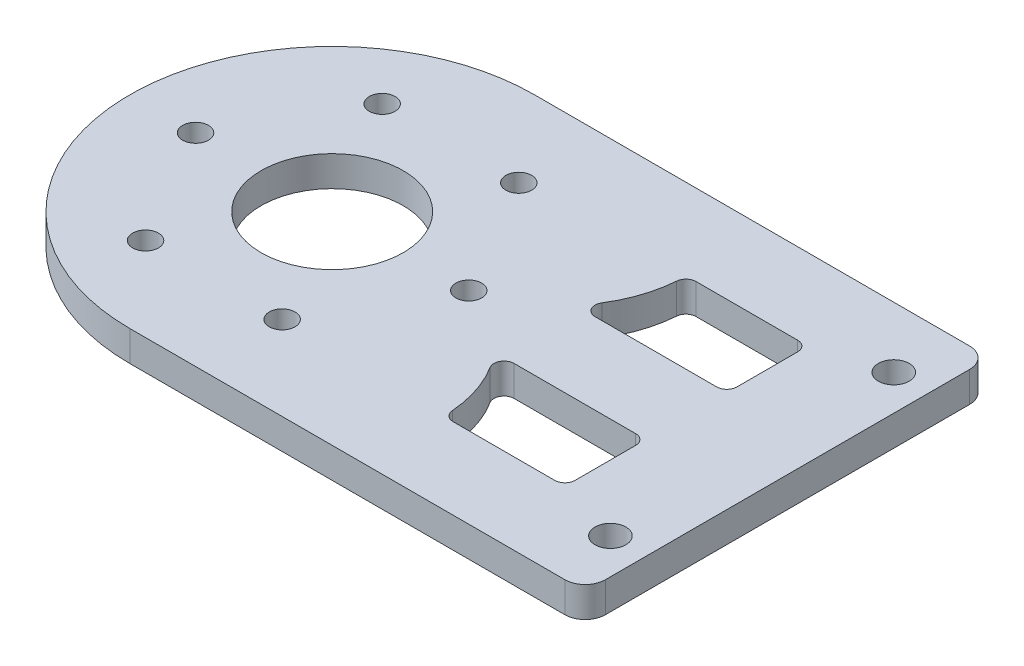
ISO-10303-21;
HEADER;
FILE_DESCRIPTION(('STEP AP214'),'2;1');
FILE_NAME('part.step','',(''),(''),'','','');
FILE_SCHEMA(('AUTOMOTIVE_DESIGN { 1 0 10303 214 1 1 1 1 }'));
ENDSEC;
DATA;
#1=APPLICATION_CONTEXT('core data for automotive mechanical design processes');
#2=APPLICATION_PROTOCOL_DEFINITION('international standard','automotive_design',2000,#1);
#3=PRODUCT_CONTEXT('',#1,'mechanical');
#4=PRODUCT('Part','Part','',(#3));
#5=PRODUCT_RELATED_PRODUCT_CATEGORY('part','',(#4));
#6=PRODUCT_DEFINITION_FORMATION('','',#4);
#7=PRODUCT_DEFINITION_CONTEXT('part definition',#1,'design');
#8=PRODUCT_DEFINITION('design','',#6,#7);
#9=PRODUCT_DEFINITION_SHAPE('','',#8);
#10=(LENGTH_UNIT() NAMED_UNIT(*) SI_UNIT(.MILLI.,.METRE.));
#11=(NAMED_UNIT(*) PLANE_ANGLE_UNIT() SI_UNIT($,.RADIAN.));
#12=(NAMED_UNIT(*) SI_UNIT($,.STERADIAN.) SOLID_ANGLE_UNIT());
#13=UNCERTAINTY_MEASURE_WITH_UNIT(LENGTH_MEASURE(1.E-05),#10,'distance_accuracy_value','');
#14=(GEOMETRIC_REPRESENTATION_CONTEXT(3) GLOBAL_UNCERTAINTY_ASSIGNED_CONTEXT((#13)) GLOBAL_UNIT_ASSIGNED_CONTEXT((#10,
#11,#12)) REPRESENTATION_CONTEXT('',''));
#15=CARTESIAN_POINT('',(0.,0.,0.));
#16=DIRECTION('',(0.,0.,1.));
#17=DIRECTION('',(1.,0.,0.));
#18=AXIS2_PLACEMENT_3D('',#15,#16,#17);
#19=CARTESIAN_POINT('',(0.,0.,0.));
#20=DIRECTION('',(0.,1.,0.));
#21=DIRECTION('',(0.,0.,1.));
#22=AXIS2_PLACEMENT_3D('',#19,#20,#21);
#23=PLANE('',#22);
#24=CARTESIAN_POINT('',(-11.6666666651634,0.,-12.0000000016373));
#25=DIRECTION('',(0.,1.,0.));
#26=DIRECTION('',(0.,0.,1.));
#27=AXIS2_PLACEMENT_3D('',#24,#25,#26);
#28=CIRCLE('',#27,12.1666666666667);
#29=CARTESIAN_POINT('',(-1.36190229421553,0.,-5.53164557125699));
#30=VERTEX_POINT('',#29);
#31=CARTESIAN_POINT('',(0.464858721431306,0.,-11.0759493687252));
#32=VERTEX_POINT('',#31);
#33=EDGE_CURVE('E305',#30,#32,#28,.T.);
#34=ORIENTED_EDGE('',*,*,#33,.F.);
#35=CARTESIAN_POINT('',(-0.514935359617072,0.,-5.0000000016367));
#36=DIRECTION('',(0.,1.,0.));
#37=DIRECTION('',(0.,0.,1.));
#38=AXIS2_PLACEMENT_3D('',#35,#36,#37);
#39=CIRCLE('',#38,1.);
#40=CARTESIAN_POINT('',(-0.514935359617072,0.,-4.0000000016367));
#41=VERTEX_POINT('',#40);
#42=EDGE_CURVE('E282',#41,#30,#39,.F.);
#43=ORIENTED_EDGE('',*,*,#42,.F.);
#44=DIRECTION('',(-1.,0.,0.));
#45=VECTOR('',#44,1.);
#46=CARTESIAN_POINT('',(2.14838320450944E-13,0.,-4.00000000163667));
#47=LINE('',#46,#45);
#48=CARTESIAN_POINT('',(11.5000000015028,0.,-4.00000000163605));
#49=VERTEX_POINT('',#48);
#50=EDGE_CURVE('E250',#49,#41,#47,.T.);
#51=ORIENTED_EDGE('',*,*,#50,.F.);
#52=CARTESIAN_POINT('',(11.5000000015029,0.,-5.00000000163605));
#53=DIRECTION('',(0.,1.,0.));
#54=DIRECTION('',(0.,0.,1.));
#55=AXIS2_PLACEMENT_3D('',#52,#53,#54);
#56=CIRCLE('',#55,1.);
#57=CARTESIAN_POINT('',(12.5000000015029,0.,-5.000000001636));
#58=VERTEX_POINT('',#57);
#59=EDGE_CURVE('E295',#58,#49,#56,.F.);
#60=ORIENTED_EDGE('',*,*,#59,.F.);
#61=DIRECTION('',(0.,0.,1.));
#62=VECTOR('',#61,1.);
#63=CARTESIAN_POINT('',(12.5000000015026,0.,6.68591339779764E-13));
#64=LINE('',#63,#62);
#65=CARTESIAN_POINT('',(12.5000000015032,0.,-11.000000001636));
#66=VERTEX_POINT('',#65);
#67=EDGE_CURVE('E297',#66,#58,#64,.T.);
#68=ORIENTED_EDGE('',*,*,#67,.F.);
#69=CARTESIAN_POINT('',(11.5000000015032,0.,-11.000000001636));
#70=DIRECTION('',(0.,1.,0.));
#71=DIRECTION('',(0.,0.,1.));
#72=AXIS2_PLACEMENT_3D('',#69,#70,#71);
#73=CIRCLE('',#72,1.);
#74=CARTESIAN_POINT('',(11.5000000015032,0.,-12.0000000016361));
#75=VERTEX_POINT('',#74);
#76=EDGE_CURVE('E299',#75,#66,#73,.F.);
#77=ORIENTED_EDGE('',*,*,#76,.F.);
#78=DIRECTION('',(1.,0.,0.));
#79=VECTOR('',#78,1.);
#80=CARTESIAN_POINT('',(6.40798533503077E-13,0.,-12.0000000016367));
#81=LINE('',#80,#79);
#82=CARTESIAN_POINT('',(1.46197039704183,0.,-12.0000000016366));
#83=VERTEX_POINT('',#82);
#84=EDGE_CURVE('E301',#83,#75,#81,.T.);
#85=ORIENTED_EDGE('',*,*,#84,.F.);
#86=CARTESIAN_POINT('',(1.46197039704183,0.,-11.0000000016366));
#87=DIRECTION('',(0.,1.,0.));
#88=DIRECTION('',(0.,0.,1.));
#89=AXIS2_PLACEMENT_3D('',#86,#87,#88);
#90=CIRCLE('',#89,1.);
#91=EDGE_CURVE('E303',#32,#83,#90,.F.);
#92=ORIENTED_EDGE('',*,*,#91,.F.);
#93=EDGE_LOOP('',(#34,#43,#51,#60,#68,#77,#85,#92));
#94=FACE_BOUND('',#93,.T.);
#95=CARTESIAN_POINT('',(-0.514935359617072,0.,5.0000000016367));
#96=DIRECTION('',(0.,1.,0.));
#97=DIRECTION('',(0.,0.,1.));
#98=AXIS2_PLACEMENT_3D('',#95,#96,#97);
#99=CIRCLE('',#98,1.);
#100=CARTESIAN_POINT('',(-0.514935359617126,0.,4.0000000016367));
#101=VERTEX_POINT('',#100);
#102=CARTESIAN_POINT('',(-1.36190229421553,0.,5.53164557125699));
#103=VERTEX_POINT('',#102);
#104=EDGE_CURVE('E365',#101,#103,#99,.T.);
#105=ORIENTED_EDGE('',*,*,#104,.T.);
#106=CARTESIAN_POINT('',(-11.6666666651634,0.,12.0000000016373));
#107=DIRECTION('',(0.,1.,0.));
#108=DIRECTION('',(0.,0.,1.));
#109=AXIS2_PLACEMENT_3D('',#106,#107,#108);
#110=CIRCLE('',#109,12.1666666666667);
#111=CARTESIAN_POINT('',(0.464858721431306,0.,11.0759493687252));
#112=VERTEX_POINT('',#111);
#113=EDGE_CURVE('E368',#103,#112,#110,.F.);
#114=ORIENTED_EDGE('',*,*,#113,.T.);
#115=CARTESIAN_POINT('',(1.46197039704183,0.,11.0000000016366));
#116=DIRECTION('',(0.,1.,0.));
#117=DIRECTION('',(0.,0.,1.));
#118=AXIS2_PLACEMENT_3D('',#115,#116,#117);
#119=CIRCLE('',#118,1.);
#120=CARTESIAN_POINT('',(1.46197039704183,0.,12.0000000016366));
#121=VERTEX_POINT('',#120);
#122=EDGE_CURVE('E333',#112,#121,#119,.T.);
#123=ORIENTED_EDGE('',*,*,#122,.T.);
#124=DIRECTION('',(1.,0.,0.));
#125=VECTOR('',#124,1.);
#126=CARTESIAN_POINT('',(6.40798533503077E-13,0.,12.0000000016367));
#127=LINE('',#126,#125);
#128=CARTESIAN_POINT('',(11.5000000015032,0.,12.0000000016361));
#129=VERTEX_POINT('',#128);
#130=EDGE_CURVE('E350',#121,#129,#127,.T.);
#131=ORIENTED_EDGE('',*,*,#130,.T.);
#132=CARTESIAN_POINT('',(11.5000000015032,0.,11.000000001636));
#133=DIRECTION('',(0.,1.,0.));
#134=DIRECTION('',(0.,0.,1.));
#135=AXIS2_PLACEMENT_3D('',#132,#133,#134);
#136=CIRCLE('',#135,1.);
#137=CARTESIAN_POINT('',(12.5000000015032,0.,11.000000001636));
#138=VERTEX_POINT('',#137);
#139=EDGE_CURVE('E353',#129,#138,#136,.T.);
#140=ORIENTED_EDGE('',*,*,#139,.T.);
#141=DIRECTION('',(0.,0.,-1.));
#142=VECTOR('',#141,1.);
#143=CARTESIAN_POINT('',(12.5000000015026,0.,-6.68591339779764E-13));
#144=LINE('',#143,#142);
#145=CARTESIAN_POINT('',(12.5000000015029,0.,5.000000001636));
#146=VERTEX_POINT('',#145);
#147=EDGE_CURVE('E356',#138,#146,#144,.T.);
#148=ORIENTED_EDGE('',*,*,#147,.T.);
#149=CARTESIAN_POINT('',(11.5000000015029,0.,5.00000000163605));
#150=DIRECTION('',(0.,1.,0.));
#151=DIRECTION('',(0.,0.,1.));
#152=AXIS2_PLACEMENT_3D('',#149,#150,#151);
#153=CIRCLE('',#152,1.);
#154=CARTESIAN_POINT('',(11.5000000015028,0.,4.00000000163605));
#155=VERTEX_POINT('',#154);
#156=EDGE_CURVE('E359',#146,#155,#153,.T.);
#157=ORIENTED_EDGE('',*,*,#156,.T.);
#158=DIRECTION('',(-1.,0.,0.));
#159=VECTOR('',#158,1.);
#160=CARTESIAN_POINT('',(2.14838320450944E-13,0.,4.00000000163667));
#161=LINE('',#160,#159);
#162=EDGE_CURVE('E362',#155,#101,#161,.T.);
#163=ORIENTED_EDGE('',*,*,#162,.T.);
#164=EDGE_LOOP('',(#105,#114,#123,#131,#140,#148,#157,#163));
#165=FACE_BOUND('',#164,.T.);
#166=CARTESIAN_POINT('',(19.,0.,14.000000000098));
#167=DIRECTION('',(0.,1.,0.));
#168=DIRECTION('',(0.,0.,1.));
#169=AXIS2_PLACEMENT_3D('',#166,#167,#168);
#170=CIRCLE('',#169,1.525);
#171=CARTESIAN_POINT('',(19.,0.,15.525000000098));
#172=VERTEX_POINT('',#171);
#173=EDGE_CURVE('E372',#172,#172,#170,.T.);
#174=ORIENTED_EDGE('',*,*,#173,.T.);
#175=EDGE_LOOP('',(#174));
#176=FACE_BOUND('',#175,.T.);
#177=CARTESIAN_POINT('',(19.,0.,-14.000000000098));
#178=DIRECTION('',(0.,1.,0.));
#179=DIRECTION('',(0.,0.,1.));
#180=AXIS2_PLACEMENT_3D('',#177,#178,#179);
#181=CIRCLE('',#180,1.525);
#182=CARTESIAN_POINT('',(19.,0.,-12.475000000098));
#183=VERTEX_POINT('',#182);
#184=EDGE_CURVE('E379',#183,#183,#181,.T.);
#185=ORIENTED_EDGE('',*,*,#184,.T.);
#186=EDGE_LOOP('',(#185));
#187=FACE_BOUND('',#186,.T.);
#188=CARTESIAN_POINT('',(-22.5,0.,0.));
#189=DIRECTION('',(0.,1.,0.));
#190=DIRECTION('',(0.,0.,1.));
#191=AXIS2_PLACEMENT_3D('',#188,#189,#190);
#192=CIRCLE('',#191,7.025);
#193=CARTESIAN_POINT('',(-22.5,0.,7.025));
#194=VERTEX_POINT('',#193);
#195=EDGE_CURVE('E384',#194,#194,#192,.T.);
#196=ORIENTED_EDGE('',*,*,#195,.T.);
#197=EDGE_LOOP('',(#196));
#198=FACE_BOUND('',#197,.T.);
#199=CARTESIAN_POINT('',(-36.,0.,0.));
#200=DIRECTION('',(0.,1.,0.));
#201=DIRECTION('',(0.,0.,1.));
#202=AXIS2_PLACEMENT_3D('',#199,#200,#201);
#203=CIRCLE('',#202,1.275);
#204=CARTESIAN_POINT('',(-36.,0.,1.275));
#205=VERTEX_POINT('',#204);
#206=EDGE_CURVE('E394',#205,#205,#203,.T.);
#207=ORIENTED_EDGE('',*,*,#206,.T.);
#208=EDGE_LOOP('',(#207));
#209=FACE_BOUND('',#208,.T.);
#210=CARTESIAN_POINT('',(-29.25,0.,11.6913429510899));
#211=DIRECTION('',(0.,1.,0.));
#212=DIRECTION('',(0.,0.,1.));
#213=AXIS2_PLACEMENT_3D('',#210,#211,#212);
#214=CIRCLE('',#213,1.275);
#215=CARTESIAN_POINT('',(-29.25,0.,12.9663429510899));
#216=VERTEX_POINT('',#215);
#217=EDGE_CURVE('E387',#216,#216,#214,.T.);
#218=ORIENTED_EDGE('',*,*,#217,.T.);
#219=EDGE_LOOP('',(#218));
#220=FACE_BOUND('',#219,.T.);
#221=CARTESIAN_POINT('',(-15.75,0.,11.6913429510899));
#222=DIRECTION('',(0.,1.,0.));
#223=DIRECTION('',(0.,0.,1.));
#224=AXIS2_PLACEMENT_3D('',#221,#222,#223);
#225=CIRCLE('',#224,1.275);
#226=CARTESIAN_POINT('',(-15.75,0.,12.9663429510899));
#227=VERTEX_POINT('',#226);
#228=EDGE_CURVE('E401',#227,#227,#225,.T.);
#229=ORIENTED_EDGE('',*,*,#228,.T.);
#230=EDGE_LOOP('',(#229));
#231=FACE_BOUND('',#230,.T.);
#232=CARTESIAN_POINT('',(-8.99999999999998,0.,0.));
#233=DIRECTION('',(0.,1.,0.));
#234=DIRECTION('',(0.,0.,1.));
#235=AXIS2_PLACEMENT_3D('',#232,#233,#234);
#236=CIRCLE('',#235,1.275);
#237=CARTESIAN_POINT('',(-8.99999999999998,0.,1.275));
#238=VERTEX_POINT('',#237);
#239=EDGE_CURVE('E418',#238,#238,#236,.T.);
#240=ORIENTED_EDGE('',*,*,#239,.T.);
#241=EDGE_LOOP('',(#240));
#242=FACE_BOUND('',#241,.T.);
#243=CARTESIAN_POINT('',(-15.75,0.,-11.6913429510899));
#244=DIRECTION('',(0.,1.,0.));
#245=DIRECTION('',(0.,0.,1.));
#246=AXIS2_PLACEMENT_3D('',#243,#244,#245);
#247=CIRCLE('',#246,1.275);
#248=CARTESIAN_POINT('',(-15.75,0.,-10.4163429510899));
#249=VERTEX_POINT('',#248);
#250=EDGE_CURVE('E412',#249,#249,#247,.T.);
#251=ORIENTED_EDGE('',*,*,#250,.T.);
#252=EDGE_LOOP('',(#251));
#253=FACE_BOUND('',#252,.T.);
#254=CARTESIAN_POINT('',(-29.25,0.,-11.6913429510899));
#255=DIRECTION('',(0.,1.,0.));
#256=DIRECTION('',(0.,0.,1.));
#257=AXIS2_PLACEMENT_3D('',#254,#255,#256);
#258=CIRCLE('',#257,1.275);
#259=CARTESIAN_POINT('',(-29.25,0.,-10.4163429510899));
#260=VERTEX_POINT('',#259);
#261=EDGE_CURVE('E406',#260,#260,#258,.T.);
#262=ORIENTED_EDGE('',*,*,#261,.T.);
#263=EDGE_LOOP('',(#262));
#264=FACE_BOUND('',#263,.T.);
#265=DIRECTION('',(0.,0.,-1.));
#266=VECTOR('',#265,1.);
#267=CARTESIAN_POINT('',(22.5,0.,0.));
#268=LINE('',#267,#266);
#269=CARTESIAN_POINT('',(22.5,0.,18.));
#270=VERTEX_POINT('',#269);
#271=CARTESIAN_POINT('',(22.5,0.,-18.));
#272=VERTEX_POINT('',#271);
#273=EDGE_CURVE('E440',#270,#272,#268,.T.);
#274=ORIENTED_EDGE('',*,*,#273,.F.);
#275=CARTESIAN_POINT('',(20.5,0.,18.));
#276=DIRECTION('',(0.,1.,0.));
#277=DIRECTION('',(0.,0.,1.));
#278=AXIS2_PLACEMENT_3D('',#275,#276,#277);
#279=CIRCLE('',#278,2.);
#280=CARTESIAN_POINT('',(20.5,0.,20.));
#281=VERTEX_POINT('',#280);
#282=EDGE_CURVE('E460',#270,#281,#279,.F.);
#283=ORIENTED_EDGE('',*,*,#282,.T.);
#284=DIRECTION('',(1.,0.,0.));
#285=VECTOR('',#284,1.);
#286=CARTESIAN_POINT('',(0.,0.,20.));
#287=LINE('',#286,#285);
#288=CARTESIAN_POINT('',(-22.5,0.,20.));
#289=VERTEX_POINT('',#288);
#290=EDGE_CURVE('E437',#289,#281,#287,.T.);
#291=ORIENTED_EDGE('',*,*,#290,.F.);
#292=CARTESIAN_POINT('',(-22.5,0.,0.));
#293=DIRECTION('',(0.,1.,0.));
#294=DIRECTION('',(0.,0.,1.));
#295=AXIS2_PLACEMENT_3D('',#292,#293,#294);
#296=CIRCLE('',#295,20.);
#297=CARTESIAN_POINT('',(-22.5,0.,-20.));
#298=VERTEX_POINT('',#297);
#299=EDGE_CURVE('E393',#298,#289,#296,.T.);
#300=ORIENTED_EDGE('',*,*,#299,.F.);
#301=DIRECTION('',(1.,0.,0.));
#302=VECTOR('',#301,1.);
#303=CARTESIAN_POINT('',(0.,0.,-20.));
#304=LINE('',#303,#302);
#305=CARTESIAN_POINT('',(20.5,0.,-20.));
#306=VERTEX_POINT('',#305);
#307=EDGE_CURVE('E430',#298,#306,#304,.T.);
#308=ORIENTED_EDGE('',*,*,#307,.T.);
#309=CARTESIAN_POINT('',(20.5,0.,-18.));
#310=DIRECTION('',(0.,1.,0.));
#311=DIRECTION('',(0.,0.,1.));
#312=AXIS2_PLACEMENT_3D('',#309,#310,#311);
#313=CIRCLE('',#312,2.);
#314=EDGE_CURVE('E458',#306,#272,#313,.F.);
#315=ORIENTED_EDGE('',*,*,#314,.T.);
#316=EDGE_LOOP('',(#274,#283,#291,#300,#308,#315));
#317=FACE_BOUND('',#316,.T.);
#318=ADVANCED_FACE('F95',(#94,#165,#176,#187,#198,#209,#220,#231,#242,#253,#264,#317),#23,.F.);
#319=CARTESIAN_POINT('',(0.,3.,20.));
#320=DIRECTION('',(0.,0.,-1.));
#321=DIRECTION('',(-1.,0.,0.));
#322=AXIS2_PLACEMENT_3D('',#319,#320,#321);
#323=PLANE('',#322);
#324=ORIENTED_EDGE('',*,*,#290,.T.);
#325=DIRECTION('',(0.,-1.,0.));
#326=VECTOR('',#325,1.);
#327=CARTESIAN_POINT('',(20.5,3.,20.));
#328=LINE('',#327,#326);
#329=CARTESIAN_POINT('',(20.5,3.,20.));
#330=VERTEX_POINT('',#329);
#331=EDGE_CURVE('E462',#281,#330,#328,.F.);
#332=ORIENTED_EDGE('',*,*,#331,.T.);
#333=DIRECTION('',(1.,0.,0.));
#334=VECTOR('',#333,1.);
#335=CARTESIAN_POINT('',(0.,3.,20.));
#336=LINE('',#335,#334);
#337=CARTESIAN_POINT('',(-22.5,3.,20.));
#338=VERTEX_POINT('',#337);
#339=EDGE_CURVE('E426',#338,#330,#336,.T.);
#340=ORIENTED_EDGE('',*,*,#339,.F.);
#341=DIRECTION('',(0.,-1.,0.));
#342=VECTOR('',#341,1.);
#343=CARTESIAN_POINT('',(-22.5,3.,20.));
#344=LINE('',#343,#342);
#345=EDGE_CURVE('E447',#338,#289,#344,.T.);
#346=ORIENTED_EDGE('',*,*,#345,.T.);
#347=EDGE_LOOP('',(#324,#332,#340,#346));
#348=FACE_BOUND('',#347,.T.);
#349=ADVANCED_FACE('F482',(#348),#323,.F.);
#350=CARTESIAN_POINT('',(22.5,3.,0.));
#351=DIRECTION('',(-1.,0.,0.));
#352=DIRECTION('',(0.,0.,1.));
#353=AXIS2_PLACEMENT_3D('',#350,#351,#352);
#354=PLANE('',#353);
#355=DIRECTION('',(0.,0.,-1.));
#356=VECTOR('',#355,1.);
#357=CARTESIAN_POINT('',(22.5,3.,0.));
#358=LINE('',#357,#356);
#359=CARTESIAN_POINT('',(22.5,3.,18.));
#360=VERTEX_POINT('',#359);
#361=CARTESIAN_POINT('',(22.5,3.,-18.));
#362=VERTEX_POINT('',#361);
#363=EDGE_CURVE('E429',#360,#362,#358,.T.);
#364=ORIENTED_EDGE('',*,*,#363,.F.);
#365=DIRECTION('',(0.,-1.,0.));
#366=VECTOR('',#365,1.);
#367=CARTESIAN_POINT('',(22.5,3.,18.));
#368=LINE('',#367,#366);
#369=EDGE_CURVE('E455',#360,#270,#368,.T.);
#370=ORIENTED_EDGE('',*,*,#369,.T.);
#371=ORIENTED_EDGE('',*,*,#273,.T.);
#372=DIRECTION('',(0.,-1.,0.));
#373=VECTOR('',#372,1.);
#374=CARTESIAN_POINT('',(22.5,3.,-18.));
#375=LINE('',#374,#373);
#376=EDGE_CURVE('E449',#272,#362,#375,.F.);
#377=ORIENTED_EDGE('',*,*,#376,.T.);
#378=EDGE_LOOP('',(#364,#370,#371,#377));
#379=FACE_BOUND('',#378,.T.);
#380=ADVANCED_FACE('F474',(#379),#354,.F.);
#381=CARTESIAN_POINT('',(0.,3.,-20.));
#382=DIRECTION('',(0.,0.,-1.));
#383=DIRECTION('',(-1.,0.,0.));
#384=AXIS2_PLACEMENT_3D('',#381,#382,#383);
#385=PLANE('',#384);
#386=DIRECTION('',(1.,0.,0.));
#387=VECTOR('',#386,1.);
#388=CARTESIAN_POINT('',(0.,3.,-20.));
#389=LINE('',#388,#387);
#390=CARTESIAN_POINT('',(-22.5,3.,-20.));
#391=VERTEX_POINT('',#390);
#392=CARTESIAN_POINT('',(20.5,3.,-20.));
#393=VERTEX_POINT('',#392);
#394=EDGE_CURVE('E433',#391,#393,#389,.T.);
#395=ORIENTED_EDGE('',*,*,#394,.T.);
#396=DIRECTION('',(0.,-1.,0.));
#397=VECTOR('',#396,1.);
#398=CARTESIAN_POINT('',(20.5,0.,-20.));
#399=LINE('',#398,#397);
#400=EDGE_CURVE('E12',#393,#306,#399,.T.);
#401=ORIENTED_EDGE('',*,*,#400,.T.);
#402=ORIENTED_EDGE('',*,*,#307,.F.);
#403=DIRECTION('',(0.,-1.,0.));
#404=VECTOR('',#403,1.);
#405=CARTESIAN_POINT('',(-22.5,3.,-20.));
#406=LINE('',#405,#404);
#407=EDGE_CURVE('E436',#391,#298,#406,.T.);
#408=ORIENTED_EDGE('',*,*,#407,.F.);
#409=EDGE_LOOP('',(#395,#401,#402,#408));
#410=FACE_BOUND('',#409,.T.);
#411=ADVANCED_FACE('F488',(#410),#385,.T.);
#412=CARTESIAN_POINT('',(0.,3.,0.));
#413=DIRECTION('',(0.,1.,0.));
#414=DIRECTION('',(0.,0.,1.));
#415=AXIS2_PLACEMENT_3D('',#412,#413,#414);
#416=PLANE('',#415);
#417=CARTESIAN_POINT('',(-0.514935359617072,3.,-5.0000000016367));
#418=DIRECTION('',(0.,-1.,0.));
#419=DIRECTION('',(0.,0.,-1.));
#420=AXIS2_PLACEMENT_3D('',#417,#418,#419);
#421=CIRCLE('',#420,1.);
#422=CARTESIAN_POINT('',(-0.514935359617126,3.,-4.0000000016367));
#423=VERTEX_POINT('',#422);
#424=CARTESIAN_POINT('',(-1.36190229421553,3.,-5.53164557125699));
#425=VERTEX_POINT('',#424);
#426=EDGE_CURVE('E256',#423,#425,#421,.T.);
#427=ORIENTED_EDGE('',*,*,#426,.T.);
#428=CARTESIAN_POINT('',(-11.6666666651634,3.,-12.0000000016373));
#429=DIRECTION('',(0.,1.,0.));
#430=DIRECTION('',(0.,0.,-1.));
#431=AXIS2_PLACEMENT_3D('',#428,#429,#430);
#432=CIRCLE('',#431,12.1666666666667);
#433=CARTESIAN_POINT('',(0.464858721431306,3.,-11.0759493687252));
#434=VERTEX_POINT('',#433);
#435=EDGE_CURVE('E118',#425,#434,#432,.T.);
#436=ORIENTED_EDGE('',*,*,#435,.T.);
#437=CARTESIAN_POINT('',(1.46197039704183,3.,-11.0000000016366));
#438=DIRECTION('',(0.,-1.,0.));
#439=DIRECTION('',(0.,0.,-1.));
#440=AXIS2_PLACEMENT_3D('',#437,#438,#439);
#441=CIRCLE('',#440,1.);
#442=CARTESIAN_POINT('',(1.46197039704183,3.,-12.0000000016366));
#443=VERTEX_POINT('',#442);
#444=EDGE_CURVE('E277',#434,#443,#441,.T.);
#445=ORIENTED_EDGE('',*,*,#444,.T.);
#446=DIRECTION('',(1.,0.,0.));
#447=VECTOR('',#446,1.);
#448=CARTESIAN_POINT('',(11.5000000015032,3.,-12.0000000016361));
#449=LINE('',#448,#447);
#450=CARTESIAN_POINT('',(11.5000000015032,3.,-12.0000000016361));
#451=VERTEX_POINT('',#450);
#452=EDGE_CURVE('E274',#443,#451,#449,.T.);
#453=ORIENTED_EDGE('',*,*,#452,.T.);
#454=CARTESIAN_POINT('',(11.5000000015032,3.,-11.000000001636));
#455=DIRECTION('',(0.,-1.,0.));
#456=DIRECTION('',(0.,0.,-1.));
#457=AXIS2_PLACEMENT_3D('',#454,#455,#456);
#458=CIRCLE('',#457,1.);
#459=CARTESIAN_POINT('',(12.5000000015032,3.,-11.000000001636));
#460=VERTEX_POINT('',#459);
#461=EDGE_CURVE('E271',#451,#460,#458,.T.);
#462=ORIENTED_EDGE('',*,*,#461,.T.);
#463=DIRECTION('',(0.,0.,1.));
#464=VECTOR('',#463,1.);
#465=CARTESIAN_POINT('',(12.5000000015029,3.,-5.000000001636));
#466=LINE('',#465,#464);
#467=CARTESIAN_POINT('',(12.5000000015029,3.,-5.000000001636));
#468=VERTEX_POINT('',#467);
#469=EDGE_CURVE('E266',#460,#468,#466,.T.);
#470=ORIENTED_EDGE('',*,*,#469,.T.);
#471=CARTESIAN_POINT('',(11.5000000015029,3.,-5.00000000163605));
#472=DIRECTION('',(0.,-1.,0.));
#473=DIRECTION('',(0.,0.,-1.));
#474=AXIS2_PLACEMENT_3D('',#471,#472,#473);
#475=CIRCLE('',#474,1.);
#476=CARTESIAN_POINT('',(11.5000000015028,3.,-4.00000000163605));
#477=VERTEX_POINT('',#476);
#478=EDGE_CURVE('E264',#468,#477,#475,.T.);
#479=ORIENTED_EDGE('',*,*,#478,.T.);
#480=DIRECTION('',(-1.,0.,0.));
#481=VECTOR('',#480,1.);
#482=CARTESIAN_POINT('',(-0.514935359617126,3.,-4.0000000016367));
#483=LINE('',#482,#481);
#484=EDGE_CURVE('E247',#477,#423,#483,.T.);
#485=ORIENTED_EDGE('',*,*,#484,.T.);
#486=EDGE_LOOP('',(#427,#436,#445,#453,#462,#470,#479,#485));
#487=FACE_BOUND('',#486,.T.);
#488=CARTESIAN_POINT('',(-11.6666666651634,3.,12.0000000016373));
#489=DIRECTION('',(0.,-1.,0.));
#490=DIRECTION('',(0.,0.,1.));
#491=AXIS2_PLACEMENT_3D('',#488,#489,#490);
#492=CIRCLE('',#491,12.1666666666667);
#493=CARTESIAN_POINT('',(-1.36190229421553,3.,5.53164557125699));
#494=VERTEX_POINT('',#493);
#495=CARTESIAN_POINT('',(0.464858721431306,3.,11.0759493687252));
#496=VERTEX_POINT('',#495);
#497=EDGE_CURVE('E307',#494,#496,#492,.T.);
#498=ORIENTED_EDGE('',*,*,#497,.F.);
#499=CARTESIAN_POINT('',(-0.514935359617072,3.,5.0000000016367));
#500=DIRECTION('',(0.,1.,0.));
#501=DIRECTION('',(0.,0.,1.));
#502=AXIS2_PLACEMENT_3D('',#499,#500,#501);
#503=CIRCLE('',#502,1.);
#504=CARTESIAN_POINT('',(-0.514935359617126,3.,4.0000000016367));
#505=VERTEX_POINT('',#504);
#506=EDGE_CURVE('E327',#505,#494,#503,.T.);
#507=ORIENTED_EDGE('',*,*,#506,.F.);
#508=DIRECTION('',(-1.,0.,0.));
#509=VECTOR('',#508,1.);
#510=CARTESIAN_POINT('',(-0.514935359617126,3.,4.0000000016367));
#511=LINE('',#510,#509);
#512=CARTESIAN_POINT('',(11.5000000015028,3.,4.00000000163605));
#513=VERTEX_POINT('',#512);
#514=EDGE_CURVE('E324',#513,#505,#511,.T.);
#515=ORIENTED_EDGE('',*,*,#514,.F.);
#516=CARTESIAN_POINT('',(11.5000000015029,3.,5.00000000163605));
#517=DIRECTION('',(0.,1.,0.));
#518=DIRECTION('',(0.,0.,1.));
#519=AXIS2_PLACEMENT_3D('',#516,#517,#518);
#520=CIRCLE('',#519,1.);
#521=CARTESIAN_POINT('',(12.5000000015029,3.,5.000000001636));
#522=VERTEX_POINT('',#521);
#523=EDGE_CURVE('E321',#522,#513,#520,.T.);
#524=ORIENTED_EDGE('',*,*,#523,.F.);
#525=DIRECTION('',(0.,0.,-1.));
#526=VECTOR('',#525,1.);
#527=CARTESIAN_POINT('',(12.5000000015029,3.,5.000000001636));
#528=LINE('',#527,#526);
#529=CARTESIAN_POINT('',(12.5000000015032,3.,11.000000001636));
#530=VERTEX_POINT('',#529);
#531=EDGE_CURVE('E318',#530,#522,#528,.T.);
#532=ORIENTED_EDGE('',*,*,#531,.F.);
#533=CARTESIAN_POINT('',(11.5000000015032,3.,11.000000001636));
#534=DIRECTION('',(0.,1.,0.));
#535=DIRECTION('',(0.,0.,1.));
#536=AXIS2_PLACEMENT_3D('',#533,#534,#535);
#537=CIRCLE('',#536,1.);
#538=CARTESIAN_POINT('',(11.5000000015032,3.,12.0000000016361));
#539=VERTEX_POINT('',#538);
#540=EDGE_CURVE('E315',#539,#530,#537,.T.);
#541=ORIENTED_EDGE('',*,*,#540,.F.);
#542=DIRECTION('',(1.,0.,0.));
#543=VECTOR('',#542,1.);
#544=CARTESIAN_POINT('',(11.5000000015032,3.,12.0000000016361));
#545=LINE('',#544,#543);
#546=CARTESIAN_POINT('',(1.46197039704183,3.,12.0000000016366));
#547=VERTEX_POINT('',#546);
#548=EDGE_CURVE('E312',#547,#539,#545,.T.);
#549=ORIENTED_EDGE('',*,*,#548,.F.);
#550=CARTESIAN_POINT('',(1.46197039704183,3.,11.0000000016366));
#551=DIRECTION('',(0.,1.,0.));
#552=DIRECTION('',(0.,0.,1.));
#553=AXIS2_PLACEMENT_3D('',#550,#551,#552);
#554=CIRCLE('',#553,1.);
#555=EDGE_CURVE('E309',#496,#547,#554,.T.);
#556=ORIENTED_EDGE('',*,*,#555,.F.);
#557=EDGE_LOOP('',(#498,#507,#515,#524,#532,#541,#549,#556));
#558=FACE_BOUND('',#557,.T.);
#559=CARTESIAN_POINT('',(19.,3.,14.000000000098));
#560=DIRECTION('',(0.,1.,0.));
#561=DIRECTION('',(0.,0.,1.));
#562=AXIS2_PLACEMENT_3D('',#559,#560,#561);
#563=CIRCLE('',#562,1.525);
#564=CARTESIAN_POINT('',(19.,3.,15.525000000098));
#565=VERTEX_POINT('',#564);
#566=EDGE_CURVE('E376',#565,#565,#563,.T.);
#567=ORIENTED_EDGE('',*,*,#566,.F.);
#568=EDGE_LOOP('',(#567));
#569=FACE_BOUND('',#568,.T.);
#570=CARTESIAN_POINT('',(19.,3.,-14.000000000098));
#571=DIRECTION('',(0.,1.,0.));
#572=DIRECTION('',(0.,0.,1.));
#573=AXIS2_PLACEMENT_3D('',#570,#571,#572);
#574=CIRCLE('',#573,1.525);
#575=CARTESIAN_POINT('',(19.,3.,-12.475000000098));
#576=VERTEX_POINT('',#575);
#577=EDGE_CURVE('E371',#576,#576,#574,.T.);
#578=ORIENTED_EDGE('',*,*,#577,.F.);
#579=EDGE_LOOP('',(#578));
#580=FACE_BOUND('',#579,.T.);
#581=CARTESIAN_POINT('',(-22.5,3.,0.));
#582=DIRECTION('',(0.,1.,0.));
#583=DIRECTION('',(0.,0.,1.));
#584=AXIS2_PLACEMENT_3D('',#581,#582,#583);
#585=CIRCLE('',#584,7.025);
#586=CARTESIAN_POINT('',(-22.5,3.,7.025));
#587=VERTEX_POINT('',#586);
#588=EDGE_CURVE('E375',#587,#587,#585,.T.);
#589=ORIENTED_EDGE('',*,*,#588,.F.);
#590=EDGE_LOOP('',(#589));
#591=FACE_BOUND('',#590,.T.);
#592=CARTESIAN_POINT('',(-36.,3.,0.));
#593=DIRECTION('',(0.,1.,0.));
#594=DIRECTION('',(0.,0.,1.));
#595=AXIS2_PLACEMENT_3D('',#592,#593,#594);
#596=CIRCLE('',#595,1.275);
#597=CARTESIAN_POINT('',(-36.,3.,1.275));
#598=VERTEX_POINT('',#597);
#599=EDGE_CURVE('E390',#598,#598,#596,.T.);
#600=ORIENTED_EDGE('',*,*,#599,.F.);
#601=EDGE_LOOP('',(#600));
#602=FACE_BOUND('',#601,.T.);
#603=CARTESIAN_POINT('',(-29.25,3.,11.6913429510899));
#604=DIRECTION('',(0.,1.,0.));
#605=DIRECTION('',(0.,0.,1.));
#606=AXIS2_PLACEMENT_3D('',#603,#604,#605);
#607=CIRCLE('',#606,1.275);
#608=CARTESIAN_POINT('',(-29.25,3.,12.9663429510899));
#609=VERTEX_POINT('',#608);
#610=EDGE_CURVE('E398',#609,#609,#607,.T.);
#611=ORIENTED_EDGE('',*,*,#610,.F.);
#612=EDGE_LOOP('',(#611));
#613=FACE_BOUND('',#612,.T.);
#614=CARTESIAN_POINT('',(-15.75,3.,11.6913429510899));
#615=DIRECTION('',(0.,1.,0.));
#616=DIRECTION('',(0.,0.,1.));
#617=AXIS2_PLACEMENT_3D('',#614,#615,#616);
#618=CIRCLE('',#617,1.275);
#619=CARTESIAN_POINT('',(-15.75,3.,12.9663429510899));
#620=VERTEX_POINT('',#619);
#621=EDGE_CURVE('E421',#620,#620,#618,.T.);
#622=ORIENTED_EDGE('',*,*,#621,.F.);
#623=EDGE_LOOP('',(#622));
#624=FACE_BOUND('',#623,.T.);
#625=CARTESIAN_POINT('',(-8.99999999999998,3.,0.));
#626=DIRECTION('',(0.,1.,0.));
#627=DIRECTION('',(0.,0.,1.));
#628=AXIS2_PLACEMENT_3D('',#625,#626,#627);
#629=CIRCLE('',#628,1.275);
#630=CARTESIAN_POINT('',(-8.99999999999998,3.,1.275));
#631=VERTEX_POINT('',#630);
#632=EDGE_CURVE('E415',#631,#631,#629,.T.);
#633=ORIENTED_EDGE('',*,*,#632,.F.);
#634=EDGE_LOOP('',(#633));
#635=FACE_BOUND('',#634,.T.);
#636=CARTESIAN_POINT('',(-15.75,3.,-11.6913429510899));
#637=DIRECTION('',(0.,1.,0.));
#638=DIRECTION('',(0.,0.,1.));
#639=AXIS2_PLACEMENT_3D('',#636,#637,#638);
#640=CIRCLE('',#639,1.275);
#641=CARTESIAN_POINT('',(-15.75,3.,-10.4163429510899));
#642=VERTEX_POINT('',#641);
#643=EDGE_CURVE('E409',#642,#642,#640,.T.);
#644=ORIENTED_EDGE('',*,*,#643,.F.);
#645=EDGE_LOOP('',(#644));
#646=FACE_BOUND('',#645,.T.);
#647=CARTESIAN_POINT('',(-29.25,3.,-11.6913429510899));
#648=DIRECTION('',(0.,1.,0.));
#649=DIRECTION('',(0.,0.,1.));
#650=AXIS2_PLACEMENT_3D('',#647,#648,#649);
#651=CIRCLE('',#650,1.275);
#652=CARTESIAN_POINT('',(-29.25,3.,-10.4163429510899));
#653=VERTEX_POINT('',#652);
#654=EDGE_CURVE('E397',#653,#653,#651,.T.);
#655=ORIENTED_EDGE('',*,*,#654,.F.);
#656=EDGE_LOOP('',(#655));
#657=FACE_BOUND('',#656,.T.);
#658=ORIENTED_EDGE('',*,*,#339,.T.);
#659=CARTESIAN_POINT('',(20.5,3.,18.));
#660=DIRECTION('',(0.,1.,0.));
#661=DIRECTION('',(0.,0.,1.));
#662=AXIS2_PLACEMENT_3D('',#659,#660,#661);
#663=CIRCLE('',#662,2.);
#664=EDGE_CURVE('E103',#330,#360,#663,.T.);
#665=ORIENTED_EDGE('',*,*,#664,.T.);
#666=ORIENTED_EDGE('',*,*,#363,.T.);
#667=CARTESIAN_POINT('',(20.5,3.,-18.));
#668=DIRECTION('',(0.,1.,0.));
#669=DIRECTION('',(0.,0.,1.));
#670=AXIS2_PLACEMENT_3D('',#667,#668,#669);
#671=CIRCLE('',#670,2.);
#672=EDGE_CURVE('E464',#362,#393,#671,.T.);
#673=ORIENTED_EDGE('',*,*,#672,.T.);
#674=ORIENTED_EDGE('',*,*,#394,.F.);
#675=CARTESIAN_POINT('',(-22.5,3.,0.));
#676=DIRECTION('',(0.,1.,0.));
#677=DIRECTION('',(0.,0.,1.));
#678=AXIS2_PLACEMENT_3D('',#675,#676,#677);
#679=CIRCLE('',#678,20.);
#680=EDGE_CURVE('E441',#391,#338,#679,.T.);
#681=ORIENTED_EDGE('',*,*,#680,.T.);
#682=EDGE_LOOP('',(#658,#665,#666,#673,#674,#681));
#683=FACE_BOUND('',#682,.T.);
#684=ADVANCED_FACE('F260',(#487,#558,#569,#580,#591,#602,#613,#624,#635,#646,#657,#683),#416,.T.);
#685=CARTESIAN_POINT('',(-22.5,3.,0.));
#686=DIRECTION('',(0.,-1.,0.));
#687=DIRECTION('',(0.,0.,-1.));
#688=AXIS2_PLACEMENT_3D('',#685,#686,#687);
#689=CYLINDRICAL_SURFACE('',#688,20.);
#690=ORIENTED_EDGE('',*,*,#407,.T.);
#691=ORIENTED_EDGE('',*,*,#299,.T.);
#692=ORIENTED_EDGE('',*,*,#345,.F.);
#693=ORIENTED_EDGE('',*,*,#680,.F.);
#694=EDGE_LOOP('',(#690,#691,#692,#693));
#695=FACE_BOUND('',#694,.T.);
#696=ADVANCED_FACE('F485',(#695),#689,.T.);
#697=CARTESIAN_POINT('',(-29.25,3.,-11.6913429510899));
#698=DIRECTION('',(0.,-1.,0.));
#699=DIRECTION('',(0.,0.,-1.));
#700=AXIS2_PLACEMENT_3D('',#697,#698,#699);
#701=CYLINDRICAL_SURFACE('',#700,1.275);
#702=ORIENTED_EDGE('',*,*,#654,.T.);
#703=EDGE_LOOP('',(#702));
#704=FACE_BOUND('',#703,.T.);
#705=ORIENTED_EDGE('',*,*,#261,.F.);
#706=EDGE_LOOP('',(#705));
#707=FACE_BOUND('',#706,.T.);
#708=ADVANCED_FACE('F514',(#704,#707),#701,.F.);
#709=CARTESIAN_POINT('',(-15.75,3.,-11.6913429510899));
#710=DIRECTION('',(0.,-1.,0.));
#711=DIRECTION('',(0.,0.,-1.));
#712=AXIS2_PLACEMENT_3D('',#709,#710,#711);
#713=CYLINDRICAL_SURFACE('',#712,1.275);
#714=ORIENTED_EDGE('',*,*,#643,.T.);
#715=EDGE_LOOP('',(#714));
#716=FACE_BOUND('',#715,.T.);
#717=ORIENTED_EDGE('',*,*,#250,.F.);
#718=EDGE_LOOP('',(#717));
#719=FACE_BOUND('',#718,.T.);
#720=ADVANCED_FACE('F519',(#716,#719),#713,.F.);
#721=CARTESIAN_POINT('',(-8.99999999999998,3.,0.));
#722=DIRECTION('',(0.,-1.,0.));
#723=DIRECTION('',(0.,0.,-1.));
#724=AXIS2_PLACEMENT_3D('',#721,#722,#723);
#725=CYLINDRICAL_SURFACE('',#724,1.275);
#726=ORIENTED_EDGE('',*,*,#632,.T.);
#727=EDGE_LOOP('',(#726));
#728=FACE_BOUND('',#727,.T.);
#729=ORIENTED_EDGE('',*,*,#239,.F.);
#730=EDGE_LOOP('',(#729));
#731=FACE_BOUND('',#730,.T.);
#732=ADVANCED_FACE('F531',(#728,#731),#725,.F.);
#733=CARTESIAN_POINT('',(-15.75,3.,11.6913429510899));
#734=DIRECTION('',(0.,-1.,0.));
#735=DIRECTION('',(0.,0.,-1.));
#736=AXIS2_PLACEMENT_3D('',#733,#734,#735);
#737=CYLINDRICAL_SURFACE('',#736,1.275);
#738=ORIENTED_EDGE('',*,*,#621,.T.);
#739=EDGE_LOOP('',(#738));
#740=FACE_BOUND('',#739,.T.);
#741=ORIENTED_EDGE('',*,*,#228,.F.);
#742=EDGE_LOOP('',(#741));
#743=FACE_BOUND('',#742,.T.);
#744=ADVANCED_FACE('F527',(#740,#743),#737,.F.);
#745=CARTESIAN_POINT('',(-29.25,3.,11.6913429510899));
#746=DIRECTION('',(0.,-1.,0.));
#747=DIRECTION('',(0.,0.,-1.));
#748=AXIS2_PLACEMENT_3D('',#745,#746,#747);
#749=CYLINDRICAL_SURFACE('',#748,1.275);
#750=ORIENTED_EDGE('',*,*,#610,.T.);
#751=EDGE_LOOP('',(#750));
#752=FACE_BOUND('',#751,.T.);
#753=ORIENTED_EDGE('',*,*,#217,.F.);
#754=EDGE_LOOP('',(#753));
#755=FACE_BOUND('',#754,.T.);
#756=ADVANCED_FACE('F530',(#752,#755),#749,.F.);
#757=CARTESIAN_POINT('',(-36.,3.,0.));
#758=DIRECTION('',(0.,-1.,0.));
#759=DIRECTION('',(0.,0.,-1.));
#760=AXIS2_PLACEMENT_3D('',#757,#758,#759);
#761=CYLINDRICAL_SURFACE('',#760,1.275);
#762=ORIENTED_EDGE('',*,*,#599,.T.);
#763=EDGE_LOOP('',(#762));
#764=FACE_BOUND('',#763,.T.);
#765=ORIENTED_EDGE('',*,*,#206,.F.);
#766=EDGE_LOOP('',(#765));
#767=FACE_BOUND('',#766,.T.);
#768=ADVANCED_FACE('F541',(#764,#767),#761,.F.);
#769=CARTESIAN_POINT('',(-22.5,0.,0.));
#770=DIRECTION('',(0.,1.,0.));
#771=DIRECTION('',(0.,0.,1.));
#772=AXIS2_PLACEMENT_3D('',#769,#770,#771);
#773=CYLINDRICAL_SURFACE('',#772,7.025);
#774=ORIENTED_EDGE('',*,*,#195,.F.);
#775=EDGE_LOOP('',(#774));
#776=FACE_BOUND('',#775,.T.);
#777=ORIENTED_EDGE('',*,*,#588,.T.);
#778=EDGE_LOOP('',(#777));
#779=FACE_BOUND('',#778,.T.);
#780=ADVANCED_FACE('F501',(#776,#779),#773,.F.);
#781=CARTESIAN_POINT('',(20.5,3.,18.));
#782=DIRECTION('',(0.,-1.,0.));
#783=DIRECTION('',(0.,0.,-1.));
#784=AXIS2_PLACEMENT_3D('',#781,#782,#783);
#785=CYLINDRICAL_SURFACE('',#784,2.);
#786=ORIENTED_EDGE('',*,*,#664,.F.);
#787=ORIENTED_EDGE('',*,*,#331,.F.);
#788=ORIENTED_EDGE('',*,*,#282,.F.);
#789=ORIENTED_EDGE('',*,*,#369,.F.);
#790=EDGE_LOOP('',(#786,#787,#788,#789));
#791=FACE_BOUND('',#790,.T.);
#792=ADVANCED_FACE('F477',(#791),#785,.T.);
#793=CARTESIAN_POINT('',(20.5,3.,-18.));
#794=DIRECTION('',(0.,1.,0.));
#795=DIRECTION('',(0.,0.,1.));
#796=AXIS2_PLACEMENT_3D('',#793,#794,#795);
#797=CYLINDRICAL_SURFACE('',#796,2.);
#798=ORIENTED_EDGE('',*,*,#672,.F.);
#799=ORIENTED_EDGE('',*,*,#376,.F.);
#800=ORIENTED_EDGE('',*,*,#314,.F.);
#801=ORIENTED_EDGE('',*,*,#400,.F.);
#802=EDGE_LOOP('',(#798,#799,#800,#801));
#803=FACE_BOUND('',#802,.T.);
#804=ADVANCED_FACE('F97',(#803),#797,.T.);
#805=CARTESIAN_POINT('',(19.,0.,-14.000000000098));
#806=DIRECTION('',(0.,1.,0.));
#807=DIRECTION('',(0.,0.,1.));
#808=AXIS2_PLACEMENT_3D('',#805,#806,#807);
#809=CYLINDRICAL_SURFACE('',#808,1.525);
#810=ORIENTED_EDGE('',*,*,#184,.F.);
#811=EDGE_LOOP('',(#810));
#812=FACE_BOUND('',#811,.T.);
#813=ORIENTED_EDGE('',*,*,#577,.T.);
#814=EDGE_LOOP('',(#813));
#815=FACE_BOUND('',#814,.T.);
#816=ADVANCED_FACE('F493',(#812,#815),#809,.F.);
#817=CARTESIAN_POINT('',(19.,0.,14.000000000098));
#818=DIRECTION('',(0.,1.,0.));
#819=DIRECTION('',(0.,0.,1.));
#820=AXIS2_PLACEMENT_3D('',#817,#818,#819);
#821=CYLINDRICAL_SURFACE('',#820,1.525);
#822=ORIENTED_EDGE('',*,*,#173,.F.);
#823=EDGE_LOOP('',(#822));
#824=FACE_BOUND('',#823,.T.);
#825=ORIENTED_EDGE('',*,*,#566,.T.);
#826=EDGE_LOOP('',(#825));
#827=FACE_BOUND('',#826,.T.);
#828=ADVANCED_FACE('F498',(#824,#827),#821,.F.);
#829=CARTESIAN_POINT('',(-11.6666666651634,-7.,12.0000000016373));
#830=DIRECTION('',(0.,1.,0.));
#831=DIRECTION('',(0.,0.,1.));
#832=AXIS2_PLACEMENT_3D('',#829,#830,#831);
#833=CYLINDRICAL_SURFACE('',#832,12.1666666666667);
#834=DIRECTION('',(0.,1.,0.));
#835=VECTOR('',#834,1.);
#836=CARTESIAN_POINT('',(-1.36190229421553,-7.,5.53164557125699));
#837=LINE('',#836,#835);
#838=EDGE_CURVE('E331',#103,#494,#837,.T.);
#839=ORIENTED_EDGE('',*,*,#838,.T.);
#840=ORIENTED_EDGE('',*,*,#497,.T.);
#841=DIRECTION('',(0.,1.,0.));
#842=VECTOR('',#841,1.);
#843=CARTESIAN_POINT('',(0.464858721431306,-7.,11.0759493687252));
#844=LINE('',#843,#842);
#845=EDGE_CURVE('E330',#112,#496,#844,.T.);
#846=ORIENTED_EDGE('',*,*,#845,.F.);
#847=ORIENTED_EDGE('',*,*,#113,.F.);
#848=EDGE_LOOP('',(#839,#840,#846,#847));
#849=FACE_BOUND('',#848,.T.);
#850=ADVANCED_FACE('F551',(#849),#833,.T.);
#851=CARTESIAN_POINT('',(-0.514935359617072,-7.,5.0000000016367));
#852=DIRECTION('',(0.,1.,0.));
#853=DIRECTION('',(0.,0.,1.));
#854=AXIS2_PLACEMENT_3D('',#851,#852,#853);
#855=CYLINDRICAL_SURFACE('',#854,1.);
#856=DIRECTION('',(0.,1.,0.));
#857=VECTOR('',#856,1.);
#858=CARTESIAN_POINT('',(-0.514935359617126,-7.,4.0000000016367));
#859=LINE('',#858,#857);
#860=EDGE_CURVE('E334',#101,#505,#859,.T.);
#861=ORIENTED_EDGE('',*,*,#860,.T.);
#862=ORIENTED_EDGE('',*,*,#506,.T.);
#863=ORIENTED_EDGE('',*,*,#838,.F.);
#864=ORIENTED_EDGE('',*,*,#104,.F.);
#865=EDGE_LOOP('',(#861,#862,#863,#864));
#866=FACE_BOUND('',#865,.T.);
#867=ADVANCED_FACE('F555',(#866),#855,.F.);
#868=CARTESIAN_POINT('',(-0.514935359617126,-7.,4.0000000016367));
#869=DIRECTION('',(0.,0.,-1.));
#870=DIRECTION('',(-1.,0.,0.));
#871=AXIS2_PLACEMENT_3D('',#868,#869,#870);
#872=PLANE('',#871);
#873=DIRECTION('',(0.,1.,0.));
#874=VECTOR('',#873,1.);
#875=CARTESIAN_POINT('',(11.5000000015028,-7.,4.00000000163605));
#876=LINE('',#875,#874);
#877=EDGE_CURVE('E336',#155,#513,#876,.T.);
#878=ORIENTED_EDGE('',*,*,#877,.T.);
#879=ORIENTED_EDGE('',*,*,#514,.T.);
#880=ORIENTED_EDGE('',*,*,#860,.F.);
#881=ORIENTED_EDGE('',*,*,#162,.F.);
#882=EDGE_LOOP('',(#878,#879,#880,#881));
#883=FACE_BOUND('',#882,.T.);
#884=ADVANCED_FACE('F577',(#883),#872,.F.);
#885=CARTESIAN_POINT('',(11.5000000015029,-7.,5.00000000163605));
#886=DIRECTION('',(0.,1.,0.));
#887=DIRECTION('',(0.,0.,1.));
#888=AXIS2_PLACEMENT_3D('',#885,#886,#887);
#889=CYLINDRICAL_SURFACE('',#888,1.);
#890=DIRECTION('',(0.,1.,0.));
#891=VECTOR('',#890,1.);
#892=CARTESIAN_POINT('',(12.5000000015029,-7.,5.000000001636));
#893=LINE('',#892,#891);
#894=EDGE_CURVE('E338',#146,#522,#893,.T.);
#895=ORIENTED_EDGE('',*,*,#894,.T.);
#896=ORIENTED_EDGE('',*,*,#523,.T.);
#897=ORIENTED_EDGE('',*,*,#877,.F.);
#898=ORIENTED_EDGE('',*,*,#156,.F.);
#899=EDGE_LOOP('',(#895,#896,#897,#898));
#900=FACE_BOUND('',#899,.T.);
#901=ADVANCED_FACE('F573',(#900),#889,.F.);
#902=CARTESIAN_POINT('',(12.5000000015029,-7.,5.000000001636));
#903=DIRECTION('',(1.,0.,0.));
#904=DIRECTION('',(0.,0.,-1.));
#905=AXIS2_PLACEMENT_3D('',#902,#903,#904);
#906=PLANE('',#905);
#907=DIRECTION('',(0.,1.,0.));
#908=VECTOR('',#907,1.);
#909=CARTESIAN_POINT('',(12.5000000015032,-7.,11.000000001636));
#910=LINE('',#909,#908);
#911=EDGE_CURVE('E340',#138,#530,#910,.T.);
#912=ORIENTED_EDGE('',*,*,#911,.T.);
#913=ORIENTED_EDGE('',*,*,#531,.T.);
#914=ORIENTED_EDGE('',*,*,#894,.F.);
#915=ORIENTED_EDGE('',*,*,#147,.F.);
#916=EDGE_LOOP('',(#912,#913,#914,#915));
#917=FACE_BOUND('',#916,.T.);
#918=ADVANCED_FACE('F569',(#917),#906,.F.);
#919=CARTESIAN_POINT('',(11.5000000015032,-7.,11.000000001636));
#920=DIRECTION('',(0.,1.,0.));
#921=DIRECTION('',(0.,0.,1.));
#922=AXIS2_PLACEMENT_3D('',#919,#920,#921);
#923=CYLINDRICAL_SURFACE('',#922,1.);
#924=DIRECTION('',(0.,1.,0.));
#925=VECTOR('',#924,1.);
#926=CARTESIAN_POINT('',(11.5000000015032,-7.,12.0000000016361));
#927=LINE('',#926,#925);
#928=EDGE_CURVE('E342',#129,#539,#927,.T.);
#929=ORIENTED_EDGE('',*,*,#928,.T.);
#930=ORIENTED_EDGE('',*,*,#540,.T.);
#931=ORIENTED_EDGE('',*,*,#911,.F.);
#932=ORIENTED_EDGE('',*,*,#139,.F.);
#933=EDGE_LOOP('',(#929,#930,#931,#932));
#934=FACE_BOUND('',#933,.T.);
#935=ADVANCED_FACE('F565',(#934),#923,.F.);
#936=CARTESIAN_POINT('',(11.5000000015032,-7.,12.0000000016361));
#937=DIRECTION('',(0.,0.,1.));
#938=DIRECTION('',(1.,0.,0.));
#939=AXIS2_PLACEMENT_3D('',#936,#937,#938);
#940=PLANE('',#939);
#941=DIRECTION('',(0.,1.,0.));
#942=VECTOR('',#941,1.);
#943=CARTESIAN_POINT('',(1.46197039704183,-7.,12.0000000016366));
#944=LINE('',#943,#942);
#945=EDGE_CURVE('E344',#121,#547,#944,.T.);
#946=ORIENTED_EDGE('',*,*,#945,.T.);
#947=ORIENTED_EDGE('',*,*,#548,.T.);
#948=ORIENTED_EDGE('',*,*,#928,.F.);
#949=ORIENTED_EDGE('',*,*,#130,.F.);
#950=EDGE_LOOP('',(#946,#947,#948,#949));
#951=FACE_BOUND('',#950,.T.);
#952=ADVANCED_FACE('F561',(#951),#940,.F.);
#953=CARTESIAN_POINT('',(1.46197039704183,-7.,11.0000000016366));
#954=DIRECTION('',(0.,1.,0.));
#955=DIRECTION('',(0.,0.,1.));
#956=AXIS2_PLACEMENT_3D('',#953,#954,#955);
#957=CYLINDRICAL_SURFACE('',#956,1.);
#958=ORIENTED_EDGE('',*,*,#845,.T.);
#959=ORIENTED_EDGE('',*,*,#555,.T.);
#960=ORIENTED_EDGE('',*,*,#945,.F.);
#961=ORIENTED_EDGE('',*,*,#122,.F.);
#962=EDGE_LOOP('',(#958,#959,#960,#961));
#963=FACE_BOUND('',#962,.T.);
#964=ADVANCED_FACE('F557',(#963),#957,.F.);
#965=CARTESIAN_POINT('',(-11.6666666651634,-7.,-12.0000000016373));
#966=DIRECTION('',(0.,1.,0.));
#967=DIRECTION('',(0.,0.,1.));
#968=AXIS2_PLACEMENT_3D('',#965,#966,#967);
#969=CYLINDRICAL_SURFACE('',#968,12.1666666666667);
#970=ORIENTED_EDGE('',*,*,#33,.T.);
#971=DIRECTION('',(0.,1.,0.));
#972=VECTOR('',#971,1.);
#973=CARTESIAN_POINT('',(0.464858721431306,-7.,-11.0759493687252));
#974=LINE('',#973,#972);
#975=EDGE_CURVE('E280',#32,#434,#974,.T.);
#976=ORIENTED_EDGE('',*,*,#975,.T.);
#977=ORIENTED_EDGE('',*,*,#435,.F.);
#978=DIRECTION('',(0.,1.,0.));
#979=VECTOR('',#978,1.);
#980=CARTESIAN_POINT('',(-1.36190229421553,-7.,-5.53164557125699));
#981=LINE('',#980,#979);
#982=EDGE_CURVE('E253',#30,#425,#981,.T.);
#983=ORIENTED_EDGE('',*,*,#982,.F.);
#984=EDGE_LOOP('',(#970,#976,#977,#983));
#985=FACE_BOUND('',#984,.T.);
#986=ADVANCED_FACE('F560',(#985),#969,.T.);
#987=CARTESIAN_POINT('',(1.46197039704183,-7.,-11.0000000016366));
#988=DIRECTION('',(0.,1.,0.));
#989=DIRECTION('',(0.,0.,1.));
#990=AXIS2_PLACEMENT_3D('',#987,#988,#989);
#991=CYLINDRICAL_SURFACE('',#990,1.);
#992=ORIENTED_EDGE('',*,*,#91,.T.);
#993=DIRECTION('',(0.,1.,0.));
#994=VECTOR('',#993,1.);
#995=CARTESIAN_POINT('',(1.46197039704183,-7.,-12.0000000016366));
#996=LINE('',#995,#994);
#997=EDGE_CURVE('E283',#83,#443,#996,.T.);
#998=ORIENTED_EDGE('',*,*,#997,.T.);
#999=ORIENTED_EDGE('',*,*,#444,.F.);
#1000=ORIENTED_EDGE('',*,*,#975,.F.);
#1001=EDGE_LOOP('',(#992,#998,#999,#1000));
#1002=FACE_BOUND('',#1001,.T.);
#1003=ADVANCED_FACE('F587',(#1002),#991,.F.);
#1004=CARTESIAN_POINT('',(11.5000000015032,-7.,-12.0000000016361));
#1005=DIRECTION('',(0.,0.,1.));
#1006=DIRECTION('',(1.,0.,0.));
#1007=AXIS2_PLACEMENT_3D('',#1004,#1005,#1006);
#1008=PLANE('',#1007);
#1009=ORIENTED_EDGE('',*,*,#84,.T.);
#1010=DIRECTION('',(0.,1.,0.));
#1011=VECTOR('',#1010,1.);
#1012=CARTESIAN_POINT('',(11.5000000015032,-7.,-12.0000000016361));
#1013=LINE('',#1012,#1011);
#1014=EDGE_CURVE('E285',#75,#451,#1013,.T.);
#1015=ORIENTED_EDGE('',*,*,#1014,.T.);
#1016=ORIENTED_EDGE('',*,*,#452,.F.);
#1017=ORIENTED_EDGE('',*,*,#997,.F.);
#1018=EDGE_LOOP('',(#1009,#1015,#1016,#1017));
#1019=FACE_BOUND('',#1018,.T.);
#1020=ADVANCED_FACE('F603',(#1019),#1008,.T.);
#1021=CARTESIAN_POINT('',(11.5000000015032,-7.,-11.000000001636));
#1022=DIRECTION('',(0.,1.,0.));
#1023=DIRECTION('',(0.,0.,1.));
#1024=AXIS2_PLACEMENT_3D('',#1021,#1022,#1023);
#1025=CYLINDRICAL_SURFACE('',#1024,1.);
#1026=ORIENTED_EDGE('',*,*,#76,.T.);
#1027=DIRECTION('',(0.,1.,0.));
#1028=VECTOR('',#1027,1.);
#1029=CARTESIAN_POINT('',(12.5000000015032,-7.,-11.000000001636));
#1030=LINE('',#1029,#1028);
#1031=EDGE_CURVE('E287',#66,#460,#1030,.T.);
#1032=ORIENTED_EDGE('',*,*,#1031,.T.);
#1033=ORIENTED_EDGE('',*,*,#461,.F.);
#1034=ORIENTED_EDGE('',*,*,#1014,.F.);
#1035=EDGE_LOOP('',(#1026,#1032,#1033,#1034));
#1036=FACE_BOUND('',#1035,.T.);
#1037=ADVANCED_FACE('F599',(#1036),#1025,.F.);
#1038=CARTESIAN_POINT('',(12.5000000015029,-7.,-5.000000001636));
#1039=DIRECTION('',(-1.,0.,0.));
#1040=DIRECTION('',(0.,0.,1.));
#1041=AXIS2_PLACEMENT_3D('',#1038,#1039,#1040);
#1042=PLANE('',#1041);
#1043=ORIENTED_EDGE('',*,*,#67,.T.);
#1044=DIRECTION('',(0.,1.,0.));
#1045=VECTOR('',#1044,1.);
#1046=CARTESIAN_POINT('',(12.5000000015029,-7.,-5.000000001636));
#1047=LINE('',#1046,#1045);
#1048=EDGE_CURVE('E289',#58,#468,#1047,.T.);
#1049=ORIENTED_EDGE('',*,*,#1048,.T.);
#1050=ORIENTED_EDGE('',*,*,#469,.F.);
#1051=ORIENTED_EDGE('',*,*,#1031,.F.);
#1052=EDGE_LOOP('',(#1043,#1049,#1050,#1051));
#1053=FACE_BOUND('',#1052,.T.);
#1054=ADVANCED_FACE('F595',(#1053),#1042,.T.);
#1055=CARTESIAN_POINT('',(11.5000000015029,-7.,-5.00000000163605));
#1056=DIRECTION('',(0.,1.,0.));
#1057=DIRECTION('',(0.,0.,1.));
#1058=AXIS2_PLACEMENT_3D('',#1055,#1056,#1057);
#1059=CYLINDRICAL_SURFACE('',#1058,1.);
#1060=ORIENTED_EDGE('',*,*,#59,.T.);
#1061=DIRECTION('',(0.,1.,0.));
#1062=VECTOR('',#1061,1.);
#1063=CARTESIAN_POINT('',(11.5000000015028,-7.,-4.00000000163605));
#1064=LINE('',#1063,#1062);
#1065=EDGE_CURVE('E252',#49,#477,#1064,.T.);
#1066=ORIENTED_EDGE('',*,*,#1065,.T.);
#1067=ORIENTED_EDGE('',*,*,#478,.F.);
#1068=ORIENTED_EDGE('',*,*,#1048,.F.);
#1069=EDGE_LOOP('',(#1060,#1066,#1067,#1068));
#1070=FACE_BOUND('',#1069,.T.);
#1071=ADVANCED_FACE('F592',(#1070),#1059,.F.);
#1072=CARTESIAN_POINT('',(-0.514935359617126,-7.,-4.0000000016367));
#1073=DIRECTION('',(0.,0.,-1.));
#1074=DIRECTION('',(-1.,0.,0.));
#1075=AXIS2_PLACEMENT_3D('',#1072,#1073,#1074);
#1076=PLANE('',#1075);
#1077=ORIENTED_EDGE('',*,*,#50,.T.);
#1078=DIRECTION('',(0.,1.,0.));
#1079=VECTOR('',#1078,1.);
#1080=CARTESIAN_POINT('',(-0.514935359617126,-7.,-4.0000000016367));
#1081=LINE('',#1080,#1079);
#1082=EDGE_CURVE('E110',#41,#423,#1081,.T.);
#1083=ORIENTED_EDGE('',*,*,#1082,.T.);
#1084=ORIENTED_EDGE('',*,*,#484,.F.);
#1085=ORIENTED_EDGE('',*,*,#1065,.F.);
#1086=EDGE_LOOP('',(#1077,#1083,#1084,#1085));
#1087=FACE_BOUND('',#1086,.T.);
#1088=ADVANCED_FACE('F244',(#1087),#1076,.T.);
#1089=CARTESIAN_POINT('',(-0.514935359617072,-7.,-5.0000000016367));
#1090=DIRECTION('',(0.,1.,0.));
#1091=DIRECTION('',(0.,0.,1.));
#1092=AXIS2_PLACEMENT_3D('',#1089,#1090,#1091);
#1093=CYLINDRICAL_SURFACE('',#1092,1.);
#1094=ORIENTED_EDGE('',*,*,#42,.T.);
#1095=ORIENTED_EDGE('',*,*,#982,.T.);
#1096=ORIENTED_EDGE('',*,*,#426,.F.);
#1097=ORIENTED_EDGE('',*,*,#1082,.F.);
#1098=EDGE_LOOP('',(#1094,#1095,#1096,#1097));
#1099=FACE_BOUND('',#1098,.T.);
#1100=ADVANCED_FACE('F257',(#1099),#1093,.F.);
#1101=CLOSED_SHELL('',(#318,#349,#380,#411,#684,#696,#708,#720,#732,#744,#756,#768,#780,#792,
#804,#816,#828,#850,#867,#884,#901,#918,#935,#952,#964,#986,#1003,#1020,#1037,#1054,#1071,#1088,#1100));
#1102=MANIFOLD_SOLID_BREP('B2',#1101);
#1103=ADVANCED_BREP_SHAPE_REPRESENTATION('',(#18,#1102),#14);
#1104=SHAPE_DEFINITION_REPRESENTATION(#9,#1103);
ENDSEC;
END-ISO-10303-21;
